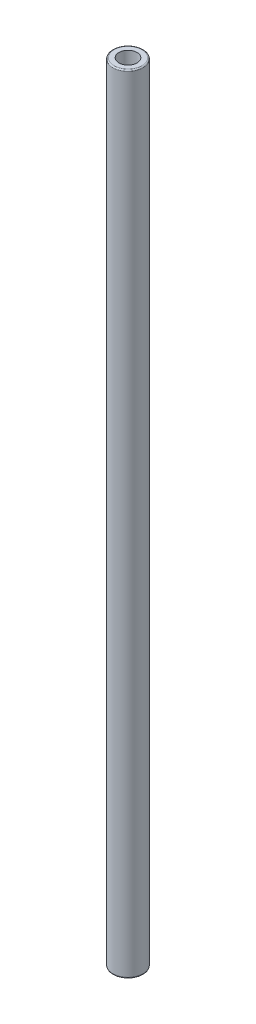
ISO-10303-21;
HEADER;
FILE_DESCRIPTION(('STEP AP214'),'2;1');
FILE_NAME('part.step','',(''),(''),'','','');
FILE_SCHEMA(('AUTOMOTIVE_DESIGN { 1 0 10303 214 1 1 1 1 }'));
ENDSEC;
DATA;
#1=APPLICATION_CONTEXT('core data for automotive mechanical design processes');
#2=APPLICATION_PROTOCOL_DEFINITION('international standard','automotive_design',2000,#1);
#3=PRODUCT_CONTEXT('',#1,'mechanical');
#4=PRODUCT('Part','Part','',(#3));
#5=PRODUCT_RELATED_PRODUCT_CATEGORY('part','',(#4));
#6=PRODUCT_DEFINITION_FORMATION('','',#4);
#7=PRODUCT_DEFINITION_CONTEXT('part definition',#1,'design');
#8=PRODUCT_DEFINITION('design','',#6,#7);
#9=PRODUCT_DEFINITION_SHAPE('','',#8);
#10=(LENGTH_UNIT() NAMED_UNIT(*) SI_UNIT(.MILLI.,.METRE.));
#11=(NAMED_UNIT(*) PLANE_ANGLE_UNIT() SI_UNIT($,.RADIAN.));
#12=(NAMED_UNIT(*) SI_UNIT($,.STERADIAN.) SOLID_ANGLE_UNIT());
#13=UNCERTAINTY_MEASURE_WITH_UNIT(LENGTH_MEASURE(1.E-05),#10,'distance_accuracy_value','');
#14=(GEOMETRIC_REPRESENTATION_CONTEXT(3) GLOBAL_UNCERTAINTY_ASSIGNED_CONTEXT((#13)) GLOBAL_UNIT_ASSIGNED_CONTEXT((#10,
#11,#12)) REPRESENTATION_CONTEXT('',''));
#15=CARTESIAN_POINT('',(0.,0.,0.));
#16=DIRECTION('',(0.,0.,1.));
#17=DIRECTION('',(1.,0.,0.));
#18=AXIS2_PLACEMENT_3D('',#15,#16,#17);
#19=CARTESIAN_POINT('',(0.,65.,0.));
#20=DIRECTION('',(0.,1.,0.));
#21=DIRECTION('',(0.,0.,1.));
#22=AXIS2_PLACEMENT_3D('',#19,#20,#21);
#23=PLANE('',#22);
#24=CARTESIAN_POINT('',(0.,65.,0.));
#25=DIRECTION('',(0.,1.,0.));
#26=DIRECTION('',(0.,0.,1.));
#27=AXIS2_PLACEMENT_3D('',#24,#25,#26);
#28=CIRCLE('',#27,2.3);
#29=CARTESIAN_POINT('',(0.,65.,2.3));
#30=VERTEX_POINT('',#29);
#31=EDGE_CURVE('E10',#30,#30,#28,.T.);
#32=ORIENTED_EDGE('',*,*,#31,.T.);
#33=EDGE_LOOP('',(#32));
#34=FACE_BOUND('',#33,.T.);
#35=CARTESIAN_POINT('',(0.,65.,0.));
#36=DIRECTION('',(0.,1.,0.));
#37=DIRECTION('',(0.,0.,1.));
#38=AXIS2_PLACEMENT_3D('',#35,#36,#37);
#39=CIRCLE('',#38,1.5);
#40=CARTESIAN_POINT('',(0.,65.,1.5));
#41=VERTEX_POINT('',#40);
#42=EDGE_CURVE('E59',#41,#41,#39,.T.);
#43=ORIENTED_EDGE('',*,*,#42,.F.);
#44=EDGE_LOOP('',(#43));
#45=FACE_BOUND('',#44,.T.);
#46=ADVANCED_FACE('F39',(#34,#45),#23,.T.);
#47=CARTESIAN_POINT('',(0.,-65.,0.));
#48=DIRECTION('',(0.,1.,0.));
#49=DIRECTION('',(0.,0.,1.));
#50=AXIS2_PLACEMENT_3D('',#47,#48,#49);
#51=PLANE('',#50);
#52=CARTESIAN_POINT('',(0.,-65.,0.));
#53=DIRECTION('',(0.,1.,0.));
#54=DIRECTION('',(0.,0.,1.));
#55=AXIS2_PLACEMENT_3D('',#52,#53,#54);
#56=CIRCLE('',#55,2.3);
#57=CARTESIAN_POINT('',(0.,-65.,2.3));
#58=VERTEX_POINT('',#57);
#59=EDGE_CURVE('E46',#58,#58,#56,.F.);
#60=ORIENTED_EDGE('',*,*,#59,.T.);
#61=EDGE_LOOP('',(#60));
#62=FACE_BOUND('',#61,.T.);
#63=CARTESIAN_POINT('',(0.,-65.,0.));
#64=DIRECTION('',(0.,1.,0.));
#65=DIRECTION('',(0.,0.,1.));
#66=AXIS2_PLACEMENT_3D('',#63,#64,#65);
#67=CIRCLE('',#66,1.5);
#68=CARTESIAN_POINT('',(0.,-65.,1.5));
#69=VERTEX_POINT('',#68);
#70=EDGE_CURVE('E60',#69,#69,#67,.T.);
#71=ORIENTED_EDGE('',*,*,#70,.T.);
#72=EDGE_LOOP('',(#71));
#73=FACE_BOUND('',#72,.T.);
#74=ADVANCED_FACE('F70',(#62,#73),#51,.F.);
#75=CARTESIAN_POINT('',(0.,65.,0.));
#76=DIRECTION('',(0.,-1.,0.));
#77=DIRECTION('',(0.,0.,-1.));
#78=AXIS2_PLACEMENT_3D('',#75,#76,#77);
#79=CYLINDRICAL_SURFACE('',#78,2.5);
#80=CARTESIAN_POINT('',(0.,-64.8,0.));
#81=DIRECTION('',(0.,1.,0.));
#82=DIRECTION('',(0.,0.,1.));
#83=AXIS2_PLACEMENT_3D('',#80,#81,#82);
#84=CIRCLE('',#83,2.5);
#85=CARTESIAN_POINT('',(0.,-64.8,2.5));
#86=VERTEX_POINT('',#85);
#87=EDGE_CURVE('E50',#86,#86,#84,.T.);
#88=ORIENTED_EDGE('',*,*,#87,.T.);
#89=EDGE_LOOP('',(#88));
#90=FACE_BOUND('',#89,.T.);
#91=CARTESIAN_POINT('',(0.,64.8,0.));
#92=DIRECTION('',(0.,1.,0.));
#93=DIRECTION('',(0.,0.,1.));
#94=AXIS2_PLACEMENT_3D('',#91,#92,#93);
#95=CIRCLE('',#94,2.5);
#96=CARTESIAN_POINT('',(0.,64.8,2.5));
#97=VERTEX_POINT('',#96);
#98=EDGE_CURVE('E54',#97,#97,#95,.F.);
#99=ORIENTED_EDGE('',*,*,#98,.T.);
#100=EDGE_LOOP('',(#99));
#101=FACE_BOUND('',#100,.T.);
#102=ADVANCED_FACE('F75',(#90,#101),#79,.T.);
#103=CARTESIAN_POINT('',(0.,65.,0.));
#104=DIRECTION('',(0.,-1.,0.));
#105=DIRECTION('',(0.,0.,-1.));
#106=AXIS2_PLACEMENT_3D('',#103,#104,#105);
#107=CYLINDRICAL_SURFACE('',#106,1.5);
#108=ORIENTED_EDGE('',*,*,#42,.T.);
#109=EDGE_LOOP('',(#108));
#110=FACE_BOUND('',#109,.T.);
#111=ORIENTED_EDGE('',*,*,#70,.F.);
#112=EDGE_LOOP('',(#111));
#113=FACE_BOUND('',#112,.T.);
#114=ADVANCED_FACE('F66',(#110,#113),#107,.F.);
#115=CARTESIAN_POINT('',(0.,-64.8,0.));
#116=DIRECTION('',(0.,1.,0.));
#117=DIRECTION('',(0.,0.,1.));
#118=AXIS2_PLACEMENT_3D('',#115,#116,#117);
#119=TOROIDAL_SURFACE('',#118,2.3,0.2);
#120=ORIENTED_EDGE('',*,*,#59,.F.);
#121=EDGE_LOOP('',(#120));
#122=FACE_BOUND('',#121,.T.);
#123=ORIENTED_EDGE('',*,*,#87,.F.);
#124=EDGE_LOOP('',(#123));
#125=FACE_BOUND('',#124,.T.);
#126=ADVANCED_FACE('F81',(#122,#125),#119,.T.);
#127=CARTESIAN_POINT('',(0.,64.8,0.));
#128=DIRECTION('',(0.,1.,0.));
#129=DIRECTION('',(0.,0.,1.));
#130=AXIS2_PLACEMENT_3D('',#127,#128,#129);
#131=TOROIDAL_SURFACE('',#130,2.3,0.2);
#132=ORIENTED_EDGE('',*,*,#98,.F.);
#133=EDGE_LOOP('',(#132));
#134=FACE_BOUND('',#133,.T.);
#135=ORIENTED_EDGE('',*,*,#31,.F.);
#136=EDGE_LOOP('',(#135));
#137=FACE_BOUND('',#136,.T.);
#138=ADVANCED_FACE('F41',(#134,#137),#131,.T.);
#139=CLOSED_SHELL('',(#46,#74,#102,#114,#126,#138));
#140=MANIFOLD_SOLID_BREP('B2',#139);
#141=ADVANCED_BREP_SHAPE_REPRESENTATION('',(#18,#140),#14);
#142=SHAPE_DEFINITION_REPRESENTATION(#9,#141);
ENDSEC;
END-ISO-10303-21;
